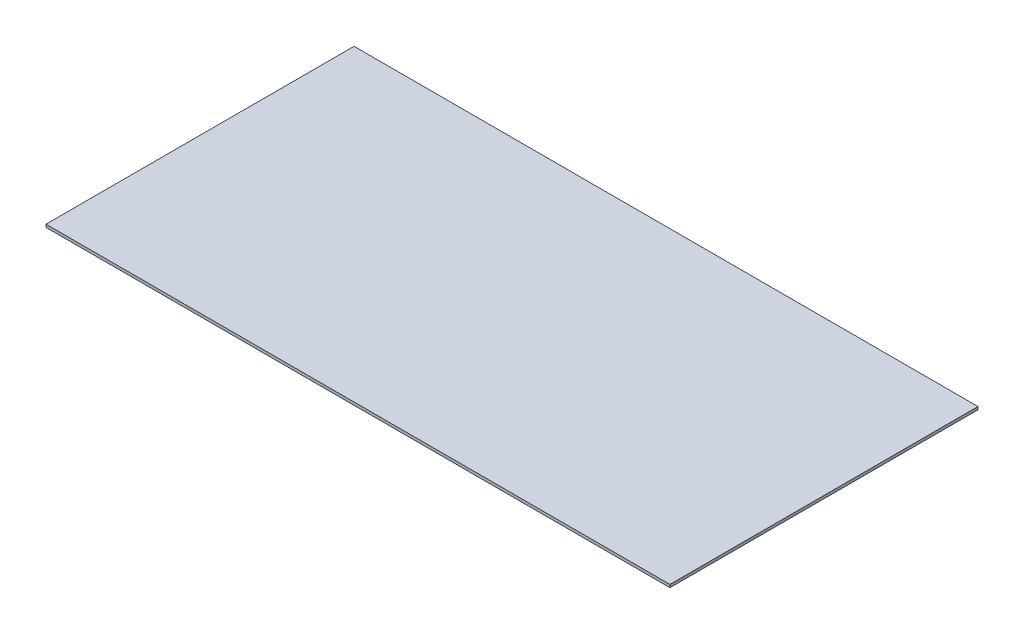
ISO-10303-21;
HEADER;
FILE_DESCRIPTION(('STEP AP214'),'2;1');
FILE_NAME('part.step','',(''),(''),'','','');
FILE_SCHEMA(('AUTOMOTIVE_DESIGN { 1 0 10303 214 1 1 1 1 }'));
ENDSEC;
DATA;
#1=APPLICATION_CONTEXT('core data for automotive mechanical design processes');
#2=APPLICATION_PROTOCOL_DEFINITION('international standard','automotive_design',2000,#1);
#3=PRODUCT_CONTEXT('',#1,'mechanical');
#4=PRODUCT('Part','Part','',(#3));
#5=PRODUCT_RELATED_PRODUCT_CATEGORY('part','',(#4));
#6=PRODUCT_DEFINITION_FORMATION('','',#4);
#7=PRODUCT_DEFINITION_CONTEXT('part definition',#1,'design');
#8=PRODUCT_DEFINITION('design','',#6,#7);
#9=PRODUCT_DEFINITION_SHAPE('','',#8);
#10=(LENGTH_UNIT() NAMED_UNIT(*) SI_UNIT(.MILLI.,.METRE.));
#11=(NAMED_UNIT(*) PLANE_ANGLE_UNIT() SI_UNIT($,.RADIAN.));
#12=(NAMED_UNIT(*) SI_UNIT($,.STERADIAN.) SOLID_ANGLE_UNIT());
#13=UNCERTAINTY_MEASURE_WITH_UNIT(LENGTH_MEASURE(1.E-05),#10,'distance_accuracy_value','');
#14=(GEOMETRIC_REPRESENTATION_CONTEXT(3) GLOBAL_UNCERTAINTY_ASSIGNED_CONTEXT((#13)) GLOBAL_UNIT_ASSIGNED_CONTEXT((#10,
#11,#12)) REPRESENTATION_CONTEXT('',''));
#15=CARTESIAN_POINT('',(0.,0.,0.));
#16=DIRECTION('',(0.,0.,1.));
#17=DIRECTION('',(1.,0.,0.));
#18=AXIS2_PLACEMENT_3D('',#15,#16,#17);
#19=CARTESIAN_POINT('',(609.6,5.55625,300.99));
#20=DIRECTION('',(-1.,0.,0.));
#21=DIRECTION('',(0.,0.,1.));
#22=AXIS2_PLACEMENT_3D('',#19,#20,#21);
#23=PLANE('',#22);
#24=DIRECTION('',(0.,0.,-1.));
#25=VECTOR('',#24,1.);
#26=CARTESIAN_POINT('',(609.6,0.,300.99));
#27=LINE('',#26,#25);
#28=CARTESIAN_POINT('',(609.6,0.,300.99));
#29=VERTEX_POINT('',#28);
#30=CARTESIAN_POINT('',(609.6,0.,-300.99));
#31=VERTEX_POINT('',#30);
#32=EDGE_CURVE('E103',#29,#31,#27,.T.);
#33=ORIENTED_EDGE('',*,*,#32,.T.);
#34=DIRECTION('',(0.,-1.,0.));
#35=VECTOR('',#34,1.);
#36=CARTESIAN_POINT('',(609.6,5.55625,-300.99));
#37=LINE('',#36,#35);
#38=CARTESIAN_POINT('',(609.6,5.55625,-300.99));
#39=VERTEX_POINT('',#38);
#40=EDGE_CURVE('E11',#39,#31,#37,.T.);
#41=ORIENTED_EDGE('',*,*,#40,.F.);
#42=DIRECTION('',(0.,0.,-1.));
#43=VECTOR('',#42,1.);
#44=CARTESIAN_POINT('',(609.6,5.55625,300.99));
#45=LINE('',#44,#43);
#46=CARTESIAN_POINT('',(609.6,5.55625,300.99));
#47=VERTEX_POINT('',#46);
#48=EDGE_CURVE('E91',#47,#39,#45,.T.);
#49=ORIENTED_EDGE('',*,*,#48,.F.);
#50=DIRECTION('',(0.,-1.,0.));
#51=VECTOR('',#50,1.);
#52=CARTESIAN_POINT('',(609.6,5.55625,300.99));
#53=LINE('',#52,#51);
#54=EDGE_CURVE('E99',#47,#29,#53,.T.);
#55=ORIENTED_EDGE('',*,*,#54,.T.);
#56=EDGE_LOOP('',(#33,#41,#49,#55));
#57=FACE_BOUND('',#56,.T.);
#58=ADVANCED_FACE('F40',(#57),#23,.F.);
#59=CARTESIAN_POINT('',(-609.6,5.55625,-300.99));
#60=DIRECTION('',(0.,0.,1.));
#61=DIRECTION('',(1.,0.,0.));
#62=AXIS2_PLACEMENT_3D('',#59,#60,#61);
#63=PLANE('',#62);
#64=DIRECTION('',(-1.,0.,0.));
#65=VECTOR('',#64,1.);
#66=CARTESIAN_POINT('',(-609.6,0.,-300.99));
#67=LINE('',#66,#65);
#68=CARTESIAN_POINT('',(-609.6,0.,-300.99));
#69=VERTEX_POINT('',#68);
#70=EDGE_CURVE('E95',#31,#69,#67,.T.);
#71=ORIENTED_EDGE('',*,*,#70,.T.);
#72=DIRECTION('',(0.,-1.,0.));
#73=VECTOR('',#72,1.);
#74=CARTESIAN_POINT('',(-609.6,5.55625,-300.99));
#75=LINE('',#74,#73);
#76=CARTESIAN_POINT('',(-609.6,5.55625,-300.99));
#77=VERTEX_POINT('',#76);
#78=EDGE_CURVE('E48',#77,#69,#75,.T.);
#79=ORIENTED_EDGE('',*,*,#78,.F.);
#80=DIRECTION('',(-1.,0.,0.));
#81=VECTOR('',#80,1.);
#82=CARTESIAN_POINT('',(-609.6,5.55625,-300.99));
#83=LINE('',#82,#81);
#84=EDGE_CURVE('E86',#39,#77,#83,.T.);
#85=ORIENTED_EDGE('',*,*,#84,.F.);
#86=ORIENTED_EDGE('',*,*,#40,.T.);
#87=EDGE_LOOP('',(#71,#79,#85,#86));
#88=FACE_BOUND('',#87,.T.);
#89=ADVANCED_FACE('F94',(#88),#63,.F.);
#90=CARTESIAN_POINT('',(-609.6,5.55625,300.99));
#91=DIRECTION('',(1.,0.,0.));
#92=DIRECTION('',(0.,0.,-1.));
#93=AXIS2_PLACEMENT_3D('',#90,#91,#92);
#94=PLANE('',#93);
#95=DIRECTION('',(0.,0.,1.));
#96=VECTOR('',#95,1.);
#97=CARTESIAN_POINT('',(-609.6,0.,300.99));
#98=LINE('',#97,#96);
#99=CARTESIAN_POINT('',(-609.6,0.,300.99));
#100=VERTEX_POINT('',#99);
#101=EDGE_CURVE('E73',#69,#100,#98,.T.);
#102=ORIENTED_EDGE('',*,*,#101,.T.);
#103=DIRECTION('',(0.,-1.,0.));
#104=VECTOR('',#103,1.);
#105=CARTESIAN_POINT('',(-609.6,5.55625,300.99));
#106=LINE('',#105,#104);
#107=CARTESIAN_POINT('',(-609.6,5.55625,300.99));
#108=VERTEX_POINT('',#107);
#109=EDGE_CURVE('E96',#108,#100,#106,.T.);
#110=ORIENTED_EDGE('',*,*,#109,.F.);
#111=DIRECTION('',(0.,0.,1.));
#112=VECTOR('',#111,1.);
#113=CARTESIAN_POINT('',(-609.6,5.55625,300.99));
#114=LINE('',#113,#112);
#115=EDGE_CURVE('E89',#77,#108,#114,.T.);
#116=ORIENTED_EDGE('',*,*,#115,.F.);
#117=ORIENTED_EDGE('',*,*,#78,.T.);
#118=EDGE_LOOP('',(#102,#110,#116,#117));
#119=FACE_BOUND('',#118,.T.);
#120=ADVANCED_FACE('F97',(#119),#94,.F.);
#121=CARTESIAN_POINT('',(-609.6,5.55625,300.99));
#122=DIRECTION('',(0.,0.,-1.));
#123=DIRECTION('',(-1.,0.,0.));
#124=AXIS2_PLACEMENT_3D('',#121,#122,#123);
#125=PLANE('',#124);
#126=DIRECTION('',(1.,0.,0.));
#127=VECTOR('',#126,1.);
#128=CARTESIAN_POINT('',(-609.6,0.,300.99));
#129=LINE('',#128,#127);
#130=EDGE_CURVE('E79',#100,#29,#129,.T.);
#131=ORIENTED_EDGE('',*,*,#130,.T.);
#132=ORIENTED_EDGE('',*,*,#54,.F.);
#133=DIRECTION('',(1.,0.,0.));
#134=VECTOR('',#133,1.);
#135=CARTESIAN_POINT('',(-609.6,5.55625,300.99));
#136=LINE('',#135,#134);
#137=EDGE_CURVE('E56',#108,#47,#136,.T.);
#138=ORIENTED_EDGE('',*,*,#137,.F.);
#139=ORIENTED_EDGE('',*,*,#109,.T.);
#140=EDGE_LOOP('',(#131,#132,#138,#139));
#141=FACE_BOUND('',#140,.T.);
#142=ADVANCED_FACE('F110',(#141),#125,.F.);
#143=CARTESIAN_POINT('',(0.,5.55625,0.));
#144=DIRECTION('',(0.,-1.,0.));
#145=DIRECTION('',(0.,0.,-1.));
#146=AXIS2_PLACEMENT_3D('',#143,#144,#145);
#147=PLANE('',#146);
#148=ORIENTED_EDGE('',*,*,#48,.T.);
#149=ORIENTED_EDGE('',*,*,#84,.T.);
#150=ORIENTED_EDGE('',*,*,#115,.T.);
#151=ORIENTED_EDGE('',*,*,#137,.T.);
#152=EDGE_LOOP('',(#148,#149,#150,#151));
#153=FACE_BOUND('',#152,.T.);
#154=ADVANCED_FACE('F87',(#153),#147,.F.);
#155=CARTESIAN_POINT('',(0.,0.,0.));
#156=DIRECTION('',(0.,-1.,0.));
#157=DIRECTION('',(0.,0.,-1.));
#158=AXIS2_PLACEMENT_3D('',#155,#156,#157);
#159=PLANE('',#158);
#160=ORIENTED_EDGE('',*,*,#32,.F.);
#161=ORIENTED_EDGE('',*,*,#130,.F.);
#162=ORIENTED_EDGE('',*,*,#101,.F.);
#163=ORIENTED_EDGE('',*,*,#70,.F.);
#164=EDGE_LOOP('',(#160,#161,#162,#163));
#165=FACE_BOUND('',#164,.T.);
#166=ADVANCED_FACE('F113',(#165),#159,.T.);
#167=CLOSED_SHELL('',(#58,#89,#120,#142,#154,#166));
#168=MANIFOLD_SOLID_BREP('B2',#167);
#169=ADVANCED_BREP_SHAPE_REPRESENTATION('',(#18,#168),#14);
#170=SHAPE_DEFINITION_REPRESENTATION(#9,#169);
ENDSEC;
END-ISO-10303-21;
